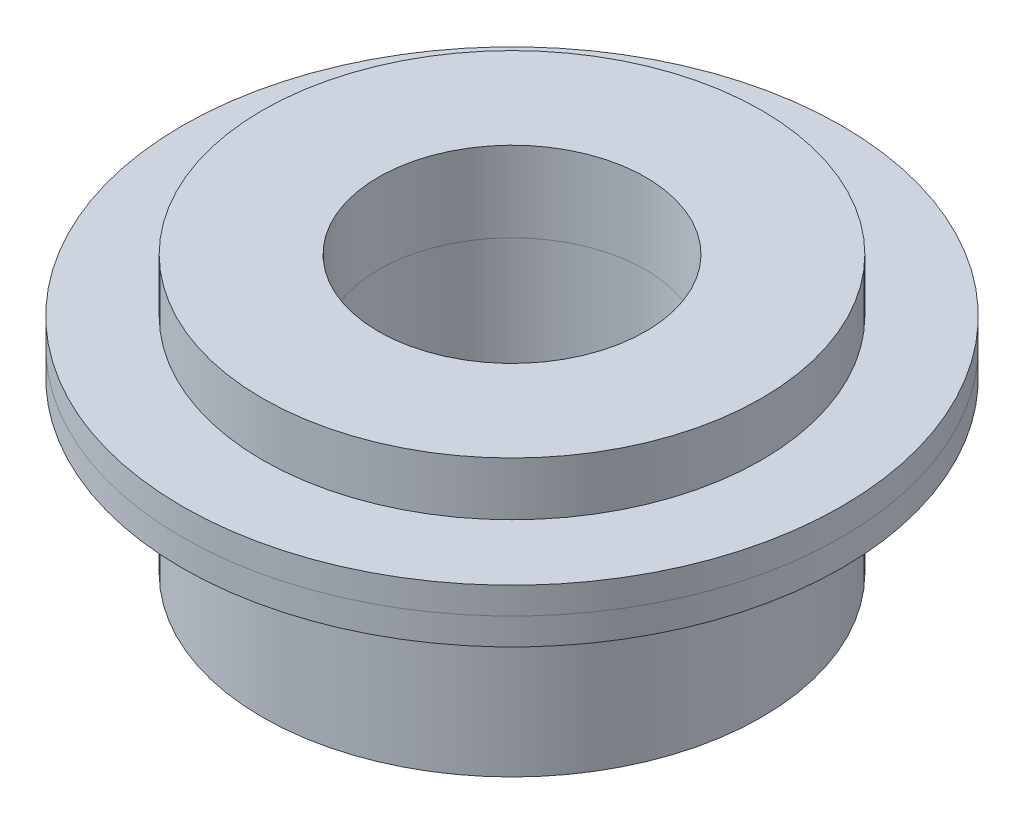
ISO-10303-21;
HEADER;
FILE_DESCRIPTION(('STEP AP214'),'2;1');
FILE_NAME('part.step','',(''),(''),'','','');
FILE_SCHEMA(('AUTOMOTIVE_DESIGN { 1 0 10303 214 1 1 1 1 }'));
ENDSEC;
DATA;
#1=APPLICATION_CONTEXT('core data for automotive mechanical design processes');
#2=APPLICATION_PROTOCOL_DEFINITION('international standard','automotive_design',2000,#1);
#3=PRODUCT_CONTEXT('',#1,'mechanical');
#4=PRODUCT('Part','Part','',(#3));
#5=PRODUCT_RELATED_PRODUCT_CATEGORY('part','',(#4));
#6=PRODUCT_DEFINITION_FORMATION('','',#4);
#7=PRODUCT_DEFINITION_CONTEXT('part definition',#1,'design');
#8=PRODUCT_DEFINITION('design','',#6,#7);
#9=PRODUCT_DEFINITION_SHAPE('','',#8);
#10=(LENGTH_UNIT() NAMED_UNIT(*) SI_UNIT(.MILLI.,.METRE.));
#11=(NAMED_UNIT(*) PLANE_ANGLE_UNIT() SI_UNIT($,.RADIAN.));
#12=(NAMED_UNIT(*) SI_UNIT($,.STERADIAN.) SOLID_ANGLE_UNIT());
#13=UNCERTAINTY_MEASURE_WITH_UNIT(LENGTH_MEASURE(1.E-05),#10,'distance_accuracy_value','');
#14=(GEOMETRIC_REPRESENTATION_CONTEXT(3) GLOBAL_UNCERTAINTY_ASSIGNED_CONTEXT((#13)) GLOBAL_UNIT_ASSIGNED_CONTEXT((#10,
#11,#12)) REPRESENTATION_CONTEXT('',''));
#15=CARTESIAN_POINT('',(0.,0.,0.));
#16=DIRECTION('',(0.,0.,1.));
#17=DIRECTION('',(1.,0.,0.));
#18=AXIS2_PLACEMENT_3D('',#15,#16,#17);
#19=CARTESIAN_POINT('',(0.,12.5,0.));
#20=DIRECTION('',(0.,-1.,0.));
#21=DIRECTION('',(0.,0.,-1.));
#22=AXIS2_PLACEMENT_3D('',#19,#20,#21);
#23=CYLINDRICAL_SURFACE('',#22,18.5);
#24=CARTESIAN_POINT('',(0.,12.5,0.));
#25=DIRECTION('',(0.,1.,0.));
#26=DIRECTION('',(0.,0.,1.));
#27=AXIS2_PLACEMENT_3D('',#24,#25,#26);
#28=CIRCLE('',#27,18.5);
#29=CARTESIAN_POINT('',(0.,12.5,18.5));
#30=VERTEX_POINT('',#29);
#31=EDGE_CURVE('E56',#30,#30,#28,.T.);
#32=ORIENTED_EDGE('',*,*,#31,.F.);
#33=EDGE_LOOP('',(#32));
#34=FACE_BOUND('',#33,.T.);
#35=CARTESIAN_POINT('',(0.,11.,0.));
#36=DIRECTION('',(0.,1.,0.));
#37=DIRECTION('',(0.,0.,1.));
#38=AXIS2_PLACEMENT_3D('',#35,#36,#37);
#39=CIRCLE('',#38,18.5);
#40=CARTESIAN_POINT('',(0.,11.,18.5));
#41=VERTEX_POINT('',#40);
#42=EDGE_CURVE('E52',#41,#41,#39,.T.);
#43=ORIENTED_EDGE('',*,*,#42,.T.);
#44=EDGE_LOOP('',(#43));
#45=FACE_BOUND('',#44,.T.);
#46=ADVANCED_FACE('F49',(#34,#45),#23,.T.);
#47=CARTESIAN_POINT('',(0.,12.5,0.));
#48=DIRECTION('',(0.,1.,0.));
#49=DIRECTION('',(0.,0.,1.));
#50=AXIS2_PLACEMENT_3D('',#47,#48,#49);
#51=PLANE('',#50);
#52=CARTESIAN_POINT('',(0.,12.5,0.));
#53=DIRECTION('',(0.,1.,0.));
#54=DIRECTION('',(0.,0.,1.));
#55=AXIS2_PLACEMENT_3D('',#52,#53,#54);
#56=CIRCLE('',#55,14.);
#57=CARTESIAN_POINT('',(0.,12.5,14.));
#58=VERTEX_POINT('',#57);
#59=EDGE_CURVE('E11',#58,#58,#56,.T.);
#60=ORIENTED_EDGE('',*,*,#59,.F.);
#61=EDGE_LOOP('',(#60));
#62=FACE_BOUND('',#61,.T.);
#63=ORIENTED_EDGE('',*,*,#31,.T.);
#64=EDGE_LOOP('',(#63));
#65=FACE_BOUND('',#64,.T.);
#66=ADVANCED_FACE('F88',(#62,#65),#51,.T.);
#67=CARTESIAN_POINT('',(0.,11.,0.));
#68=DIRECTION('',(0.,1.,0.));
#69=DIRECTION('',(0.,0.,1.));
#70=AXIS2_PLACEMENT_3D('',#67,#68,#69);
#71=PLANE('',#70);
#72=CARTESIAN_POINT('',(0.,11.,0.));
#73=DIRECTION('',(0.,1.,0.));
#74=DIRECTION('',(0.,0.,1.));
#75=AXIS2_PLACEMENT_3D('',#72,#73,#74);
#76=CIRCLE('',#75,7.5);
#77=CARTESIAN_POINT('',(0.,11.,7.5));
#78=VERTEX_POINT('',#77);
#79=EDGE_CURVE('E65',#78,#78,#76,.T.);
#80=ORIENTED_EDGE('',*,*,#79,.T.);
#81=EDGE_LOOP('',(#80));
#82=FACE_BOUND('',#81,.T.);
#83=ORIENTED_EDGE('',*,*,#42,.F.);
#84=EDGE_LOOP('',(#83));
#85=FACE_BOUND('',#84,.T.);
#86=ADVANCED_FACE('F83',(#82,#85),#71,.F.);
#87=CARTESIAN_POINT('',(0.,15.5,0.));
#88=DIRECTION('',(0.,-1.,0.));
#89=DIRECTION('',(0.,0.,-1.));
#90=AXIS2_PLACEMENT_3D('',#87,#88,#89);
#91=CYLINDRICAL_SURFACE('',#90,14.);
#92=CARTESIAN_POINT('',(0.,15.5,0.));
#93=DIRECTION('',(0.,1.,0.));
#94=DIRECTION('',(0.,0.,1.));
#95=AXIS2_PLACEMENT_3D('',#92,#93,#94);
#96=CIRCLE('',#95,14.);
#97=CARTESIAN_POINT('',(0.,15.5,14.));
#98=VERTEX_POINT('',#97);
#99=EDGE_CURVE('E62',#98,#98,#96,.T.);
#100=ORIENTED_EDGE('',*,*,#99,.F.);
#101=EDGE_LOOP('',(#100));
#102=FACE_BOUND('',#101,.T.);
#103=ORIENTED_EDGE('',*,*,#59,.T.);
#104=EDGE_LOOP('',(#103));
#105=FACE_BOUND('',#104,.T.);
#106=ADVANCED_FACE('F78',(#102,#105),#91,.T.);
#107=CARTESIAN_POINT('',(0.,15.5,0.));
#108=DIRECTION('',(0.,1.,0.));
#109=DIRECTION('',(0.,0.,1.));
#110=AXIS2_PLACEMENT_3D('',#107,#108,#109);
#111=PLANE('',#110);
#112=CARTESIAN_POINT('',(0.,15.5,0.));
#113=DIRECTION('',(0.,1.,0.));
#114=DIRECTION('',(0.,0.,1.));
#115=AXIS2_PLACEMENT_3D('',#112,#113,#114);
#116=CIRCLE('',#115,7.5);
#117=CARTESIAN_POINT('',(0.,15.5,7.5));
#118=VERTEX_POINT('',#117);
#119=EDGE_CURVE('E68',#118,#118,#116,.T.);
#120=ORIENTED_EDGE('',*,*,#119,.F.);
#121=EDGE_LOOP('',(#120));
#122=FACE_BOUND('',#121,.T.);
#123=ORIENTED_EDGE('',*,*,#99,.T.);
#124=EDGE_LOOP('',(#123));
#125=FACE_BOUND('',#124,.T.);
#126=ADVANCED_FACE('F75',(#122,#125),#111,.T.);
#127=CARTESIAN_POINT('',(0.,0.,0.));
#128=DIRECTION('',(0.,1.,0.));
#129=DIRECTION('',(0.,0.,1.));
#130=AXIS2_PLACEMENT_3D('',#127,#128,#129);
#131=CYLINDRICAL_SURFACE('',#130,7.5);
#132=ORIENTED_EDGE('',*,*,#119,.T.);
#133=EDGE_LOOP('',(#132));
#134=FACE_BOUND('',#133,.T.);
#135=ORIENTED_EDGE('',*,*,#79,.F.);
#136=EDGE_LOOP('',(#135));
#137=FACE_BOUND('',#136,.T.);
#138=ADVANCED_FACE('F72',(#134,#137),#131,.F.);
#139=CLOSED_SHELL('',(#46,#66,#86,#106,#126,#138));
#140=MANIFOLD_SOLID_BREP('B2',#139);
#141=CARTESIAN_POINT('',(0.,9.5,0.));
#142=DIRECTION('',(0.,-1.,0.));
#143=DIRECTION('',(0.,0.,-1.));
#144=AXIS2_PLACEMENT_3D('',#141,#142,#143);
#145=CYLINDRICAL_SURFACE('',#144,14.);
#146=CARTESIAN_POINT('',(0.,9.5,0.));
#147=DIRECTION('',(0.,1.,0.));
#148=DIRECTION('',(0.,0.,1.));
#149=AXIS2_PLACEMENT_3D('',#146,#147,#148);
#150=CIRCLE('',#149,14.);
#151=CARTESIAN_POINT('',(0.,9.5,14.));
#152=VERTEX_POINT('',#151);
#153=EDGE_CURVE('E48',#152,#152,#150,.T.);
#154=ORIENTED_EDGE('',*,*,#153,.F.);
#155=EDGE_LOOP('',(#154));
#156=FACE_BOUND('',#155,.T.);
#157=CARTESIAN_POINT('',(0.,0.,0.));
#158=DIRECTION('',(0.,1.,0.));
#159=DIRECTION('',(0.,0.,1.));
#160=AXIS2_PLACEMENT_3D('',#157,#158,#159);
#161=CIRCLE('',#160,14.);
#162=CARTESIAN_POINT('',(0.,0.,14.));
#163=VERTEX_POINT('',#162);
#164=EDGE_CURVE('E161',#163,#163,#161,.T.);
#165=ORIENTED_EDGE('',*,*,#164,.T.);
#166=EDGE_LOOP('',(#165));
#167=FACE_BOUND('',#166,.T.);
#168=ADVANCED_FACE('F153',(#156,#167),#145,.T.);
#169=CARTESIAN_POINT('',(0.,0.,0.));
#170=DIRECTION('',(0.,1.,0.));
#171=DIRECTION('',(0.,0.,1.));
#172=AXIS2_PLACEMENT_3D('',#169,#170,#171);
#173=PLANE('',#172);
#174=CARTESIAN_POINT('',(0.,0.,0.));
#175=DIRECTION('',(0.,1.,0.));
#176=DIRECTION('',(0.,0.,1.));
#177=AXIS2_PLACEMENT_3D('',#174,#175,#176);
#178=CIRCLE('',#177,7.5);
#179=CARTESIAN_POINT('',(0.,0.,7.5));
#180=VERTEX_POINT('',#179);
#181=EDGE_CURVE('E176',#180,#180,#178,.T.);
#182=ORIENTED_EDGE('',*,*,#181,.T.);
#183=EDGE_LOOP('',(#182));
#184=FACE_BOUND('',#183,.T.);
#185=ORIENTED_EDGE('',*,*,#164,.F.);
#186=EDGE_LOOP('',(#185));
#187=FACE_BOUND('',#186,.T.);
#188=ADVANCED_FACE('F198',(#184,#187),#173,.F.);
#189=CARTESIAN_POINT('',(0.,11.,0.));
#190=DIRECTION('',(0.,-1.,0.));
#191=DIRECTION('',(0.,0.,-1.));
#192=AXIS2_PLACEMENT_3D('',#189,#190,#191);
#193=CYLINDRICAL_SURFACE('',#192,18.5);
#194=CARTESIAN_POINT('',(0.,11.,0.));
#195=DIRECTION('',(0.,1.,0.));
#196=DIRECTION('',(0.,0.,1.));
#197=AXIS2_PLACEMENT_3D('',#194,#195,#196);
#198=CIRCLE('',#197,18.5);
#199=CARTESIAN_POINT('',(0.,11.,18.5));
#200=VERTEX_POINT('',#199);
#201=EDGE_CURVE('E167',#200,#200,#198,.T.);
#202=ORIENTED_EDGE('',*,*,#201,.F.);
#203=EDGE_LOOP('',(#202));
#204=FACE_BOUND('',#203,.T.);
#205=CARTESIAN_POINT('',(0.,9.5,0.));
#206=DIRECTION('',(0.,1.,0.));
#207=DIRECTION('',(0.,0.,1.));
#208=AXIS2_PLACEMENT_3D('',#205,#206,#207);
#209=CIRCLE('',#208,18.5);
#210=CARTESIAN_POINT('',(0.,9.5,18.5));
#211=VERTEX_POINT('',#210);
#212=EDGE_CURVE('E169',#211,#211,#209,.T.);
#213=ORIENTED_EDGE('',*,*,#212,.T.);
#214=EDGE_LOOP('',(#213));
#215=FACE_BOUND('',#214,.T.);
#216=ADVANCED_FACE('F192',(#204,#215),#193,.T.);
#217=CARTESIAN_POINT('',(0.,11.,0.));
#218=DIRECTION('',(0.,1.,0.));
#219=DIRECTION('',(0.,0.,1.));
#220=AXIS2_PLACEMENT_3D('',#217,#218,#219);
#221=PLANE('',#220);
#222=CARTESIAN_POINT('',(0.,11.,0.));
#223=DIRECTION('',(0.,1.,0.));
#224=DIRECTION('',(0.,0.,1.));
#225=AXIS2_PLACEMENT_3D('',#222,#223,#224);
#226=CIRCLE('',#225,7.5);
#227=CARTESIAN_POINT('',(0.,11.,7.5));
#228=VERTEX_POINT('',#227);
#229=EDGE_CURVE('E156',#228,#228,#226,.T.);
#230=ORIENTED_EDGE('',*,*,#229,.F.);
#231=EDGE_LOOP('',(#230));
#232=FACE_BOUND('',#231,.T.);
#233=ORIENTED_EDGE('',*,*,#201,.T.);
#234=EDGE_LOOP('',(#233));
#235=FACE_BOUND('',#234,.T.);
#236=ADVANCED_FACE('F188',(#232,#235),#221,.T.);
#237=CARTESIAN_POINT('',(0.,9.5,0.));
#238=DIRECTION('',(0.,1.,0.));
#239=DIRECTION('',(0.,0.,1.));
#240=AXIS2_PLACEMENT_3D('',#237,#238,#239);
#241=PLANE('',#240);
#242=ORIENTED_EDGE('',*,*,#153,.T.);
#243=EDGE_LOOP('',(#242));
#244=FACE_BOUND('',#243,.T.);
#245=ORIENTED_EDGE('',*,*,#212,.F.);
#246=EDGE_LOOP('',(#245));
#247=FACE_BOUND('',#246,.T.);
#248=ADVANCED_FACE('F191',(#244,#247),#241,.F.);
#249=CARTESIAN_POINT('',(0.,0.,0.));
#250=DIRECTION('',(0.,1.,0.));
#251=DIRECTION('',(0.,0.,1.));
#252=AXIS2_PLACEMENT_3D('',#249,#250,#251);
#253=CYLINDRICAL_SURFACE('',#252,7.5);
#254=ORIENTED_EDGE('',*,*,#229,.T.);
#255=EDGE_LOOP('',(#254));
#256=FACE_BOUND('',#255,.T.);
#257=ORIENTED_EDGE('',*,*,#181,.F.);
#258=EDGE_LOOP('',(#257));
#259=FACE_BOUND('',#258,.T.);
#260=ADVANCED_FACE('F185',(#256,#259),#253,.F.);
#261=CLOSED_SHELL('',(#168,#188,#216,#236,#248,#260));
#262=MANIFOLD_SOLID_BREP('B6',#261);
#263=ADVANCED_BREP_SHAPE_REPRESENTATION('',(#18,#140,#262),#14);
#264=SHAPE_DEFINITION_REPRESENTATION(#9,#263);
ENDSEC;
END-ISO-10303-21;
